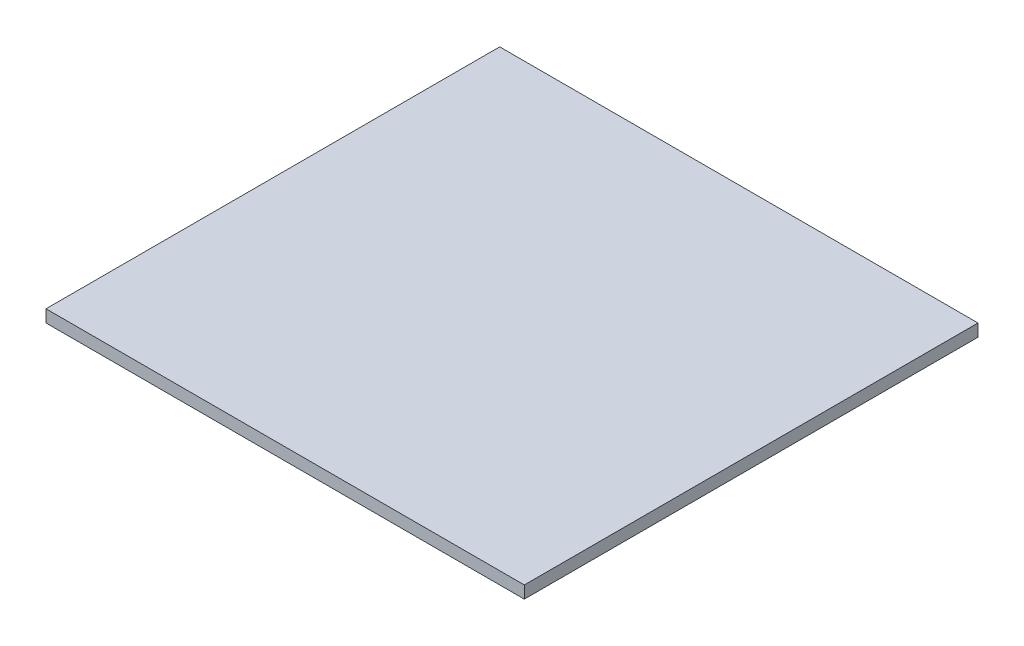
ISO-10303-21;
HEADER;
FILE_DESCRIPTION(('STEP AP214'),'2;1');
FILE_NAME('part.step','',(''),(''),'','','');
FILE_SCHEMA(('AUTOMOTIVE_DESIGN { 1 0 10303 214 1 1 1 1 }'));
ENDSEC;
DATA;
#1=APPLICATION_CONTEXT('core data for automotive mechanical design processes');
#2=APPLICATION_PROTOCOL_DEFINITION('international standard','automotive_design',2000,#1);
#3=PRODUCT_CONTEXT('',#1,'mechanical');
#4=PRODUCT('Part','Part','',(#3));
#5=PRODUCT_RELATED_PRODUCT_CATEGORY('part','',(#4));
#6=PRODUCT_DEFINITION_FORMATION('','',#4);
#7=PRODUCT_DEFINITION_CONTEXT('part definition',#1,'design');
#8=PRODUCT_DEFINITION('design','',#6,#7);
#9=PRODUCT_DEFINITION_SHAPE('','',#8);
#10=(LENGTH_UNIT() NAMED_UNIT(*) SI_UNIT(.MILLI.,.METRE.));
#11=(NAMED_UNIT(*) PLANE_ANGLE_UNIT() SI_UNIT($,.RADIAN.));
#12=(NAMED_UNIT(*) SI_UNIT($,.STERADIAN.) SOLID_ANGLE_UNIT());
#13=UNCERTAINTY_MEASURE_WITH_UNIT(LENGTH_MEASURE(1.E-05),#10,'distance_accuracy_value','');
#14=(GEOMETRIC_REPRESENTATION_CONTEXT(3) GLOBAL_UNCERTAINTY_ASSIGNED_CONTEXT((#13)) GLOBAL_UNIT_ASSIGNED_CONTEXT((#10,
#11,#12)) REPRESENTATION_CONTEXT('',''));
#15=CARTESIAN_POINT('',(0.,0.,0.));
#16=DIRECTION('',(0.,0.,1.));
#17=DIRECTION('',(1.,0.,0.));
#18=AXIS2_PLACEMENT_3D('',#15,#16,#17);
#19=CARTESIAN_POINT('',(36.9,1.9,-35.));
#20=DIRECTION('',(-1.,0.,0.));
#21=DIRECTION('',(0.,0.,1.));
#22=AXIS2_PLACEMENT_3D('',#19,#20,#21);
#23=PLANE('',#22);
#24=DIRECTION('',(0.,0.,-1.));
#25=VECTOR('',#24,1.);
#26=CARTESIAN_POINT('',(36.9,0.,-35.));
#27=LINE('',#26,#25);
#28=CARTESIAN_POINT('',(36.9,0.,35.));
#29=VERTEX_POINT('',#28);
#30=CARTESIAN_POINT('',(36.9,0.,-35.));
#31=VERTEX_POINT('',#30);
#32=EDGE_CURVE('E104',#29,#31,#27,.T.);
#33=ORIENTED_EDGE('',*,*,#32,.T.);
#34=DIRECTION('',(0.,-1.,0.));
#35=VECTOR('',#34,1.);
#36=CARTESIAN_POINT('',(36.9,1.9,-35.));
#37=LINE('',#36,#35);
#38=CARTESIAN_POINT('',(36.9,1.9,-35.));
#39=VERTEX_POINT('',#38);
#40=EDGE_CURVE('E11',#39,#31,#37,.T.);
#41=ORIENTED_EDGE('',*,*,#40,.F.);
#42=DIRECTION('',(0.,0.,-1.));
#43=VECTOR('',#42,1.);
#44=CARTESIAN_POINT('',(36.9,1.9,-35.));
#45=LINE('',#44,#43);
#46=CARTESIAN_POINT('',(36.9,1.9,35.));
#47=VERTEX_POINT('',#46);
#48=EDGE_CURVE('E92',#47,#39,#45,.T.);
#49=ORIENTED_EDGE('',*,*,#48,.F.);
#50=DIRECTION('',(0.,-1.,0.));
#51=VECTOR('',#50,1.);
#52=CARTESIAN_POINT('',(36.9,1.9,35.));
#53=LINE('',#52,#51);
#54=EDGE_CURVE('E100',#47,#29,#53,.T.);
#55=ORIENTED_EDGE('',*,*,#54,.T.);
#56=EDGE_LOOP('',(#33,#41,#49,#55));
#57=FACE_BOUND('',#56,.T.);
#58=ADVANCED_FACE('F41',(#57),#23,.F.);
#59=CARTESIAN_POINT('',(-36.9,1.9,-35.));
#60=DIRECTION('',(0.,0.,1.));
#61=DIRECTION('',(1.,0.,0.));
#62=AXIS2_PLACEMENT_3D('',#59,#60,#61);
#63=PLANE('',#62);
#64=DIRECTION('',(-1.,0.,0.));
#65=VECTOR('',#64,1.);
#66=CARTESIAN_POINT('',(-36.9,0.,-35.));
#67=LINE('',#66,#65);
#68=CARTESIAN_POINT('',(-36.9,0.,-35.));
#69=VERTEX_POINT('',#68);
#70=EDGE_CURVE('E96',#31,#69,#67,.T.);
#71=ORIENTED_EDGE('',*,*,#70,.T.);
#72=DIRECTION('',(0.,-1.,0.));
#73=VECTOR('',#72,1.);
#74=CARTESIAN_POINT('',(-36.9,1.9,-35.));
#75=LINE('',#74,#73);
#76=CARTESIAN_POINT('',(-36.9,1.9,-35.));
#77=VERTEX_POINT('',#76);
#78=EDGE_CURVE('E49',#77,#69,#75,.T.);
#79=ORIENTED_EDGE('',*,*,#78,.F.);
#80=DIRECTION('',(-1.,0.,0.));
#81=VECTOR('',#80,1.);
#82=CARTESIAN_POINT('',(-36.9,1.9,-35.));
#83=LINE('',#82,#81);
#84=EDGE_CURVE('E87',#39,#77,#83,.T.);
#85=ORIENTED_EDGE('',*,*,#84,.F.);
#86=ORIENTED_EDGE('',*,*,#40,.T.);
#87=EDGE_LOOP('',(#71,#79,#85,#86));
#88=FACE_BOUND('',#87,.T.);
#89=ADVANCED_FACE('F95',(#88),#63,.F.);
#90=CARTESIAN_POINT('',(-36.9,1.9,-35.));
#91=DIRECTION('',(1.,0.,0.));
#92=DIRECTION('',(0.,0.,-1.));
#93=AXIS2_PLACEMENT_3D('',#90,#91,#92);
#94=PLANE('',#93);
#95=DIRECTION('',(0.,0.,1.));
#96=VECTOR('',#95,1.);
#97=CARTESIAN_POINT('',(-36.9,0.,-35.));
#98=LINE('',#97,#96);
#99=CARTESIAN_POINT('',(-36.9,0.,35.));
#100=VERTEX_POINT('',#99);
#101=EDGE_CURVE('E74',#69,#100,#98,.T.);
#102=ORIENTED_EDGE('',*,*,#101,.T.);
#103=DIRECTION('',(0.,-1.,0.));
#104=VECTOR('',#103,1.);
#105=CARTESIAN_POINT('',(-36.9,1.9,35.));
#106=LINE('',#105,#104);
#107=CARTESIAN_POINT('',(-36.9,1.9,35.));
#108=VERTEX_POINT('',#107);
#109=EDGE_CURVE('E97',#108,#100,#106,.T.);
#110=ORIENTED_EDGE('',*,*,#109,.F.);
#111=DIRECTION('',(0.,0.,1.));
#112=VECTOR('',#111,1.);
#113=CARTESIAN_POINT('',(-36.9,1.9,-35.));
#114=LINE('',#113,#112);
#115=EDGE_CURVE('E90',#77,#108,#114,.T.);
#116=ORIENTED_EDGE('',*,*,#115,.F.);
#117=ORIENTED_EDGE('',*,*,#78,.T.);
#118=EDGE_LOOP('',(#102,#110,#116,#117));
#119=FACE_BOUND('',#118,.T.);
#120=ADVANCED_FACE('F98',(#119),#94,.F.);
#121=CARTESIAN_POINT('',(-36.9,1.9,35.));
#122=DIRECTION('',(0.,0.,-1.));
#123=DIRECTION('',(-1.,0.,0.));
#124=AXIS2_PLACEMENT_3D('',#121,#122,#123);
#125=PLANE('',#124);
#126=DIRECTION('',(1.,0.,0.));
#127=VECTOR('',#126,1.);
#128=CARTESIAN_POINT('',(-36.9,0.,35.));
#129=LINE('',#128,#127);
#130=EDGE_CURVE('E80',#100,#29,#129,.T.);
#131=ORIENTED_EDGE('',*,*,#130,.T.);
#132=ORIENTED_EDGE('',*,*,#54,.F.);
#133=DIRECTION('',(1.,0.,0.));
#134=VECTOR('',#133,1.);
#135=CARTESIAN_POINT('',(-36.9,1.9,35.));
#136=LINE('',#135,#134);
#137=EDGE_CURVE('E57',#108,#47,#136,.T.);
#138=ORIENTED_EDGE('',*,*,#137,.F.);
#139=ORIENTED_EDGE('',*,*,#109,.T.);
#140=EDGE_LOOP('',(#131,#132,#138,#139));
#141=FACE_BOUND('',#140,.T.);
#142=ADVANCED_FACE('F111',(#141),#125,.F.);
#143=CARTESIAN_POINT('',(0.,1.9,0.));
#144=DIRECTION('',(0.,1.,0.));
#145=DIRECTION('',(0.,0.,1.));
#146=AXIS2_PLACEMENT_3D('',#143,#144,#145);
#147=PLANE('',#146);
#148=ORIENTED_EDGE('',*,*,#48,.T.);
#149=ORIENTED_EDGE('',*,*,#84,.T.);
#150=ORIENTED_EDGE('',*,*,#115,.T.);
#151=ORIENTED_EDGE('',*,*,#137,.T.);
#152=EDGE_LOOP('',(#148,#149,#150,#151));
#153=FACE_BOUND('',#152,.T.);
#154=ADVANCED_FACE('F88',(#153),#147,.T.);
#155=CARTESIAN_POINT('',(0.,0.,0.));
#156=DIRECTION('',(0.,1.,0.));
#157=DIRECTION('',(0.,0.,1.));
#158=AXIS2_PLACEMENT_3D('',#155,#156,#157);
#159=PLANE('',#158);
#160=ORIENTED_EDGE('',*,*,#32,.F.);
#161=ORIENTED_EDGE('',*,*,#130,.F.);
#162=ORIENTED_EDGE('',*,*,#101,.F.);
#163=ORIENTED_EDGE('',*,*,#70,.F.);
#164=EDGE_LOOP('',(#160,#161,#162,#163));
#165=FACE_BOUND('',#164,.T.);
#166=ADVANCED_FACE('F114',(#165),#159,.F.);
#167=CLOSED_SHELL('',(#58,#89,#120,#142,#154,#166));
#168=MANIFOLD_SOLID_BREP('B2',#167);
#169=ADVANCED_BREP_SHAPE_REPRESENTATION('',(#18,#168),#14);
#170=SHAPE_DEFINITION_REPRESENTATION(#9,#169);
ENDSEC;
END-ISO-10303-21;
